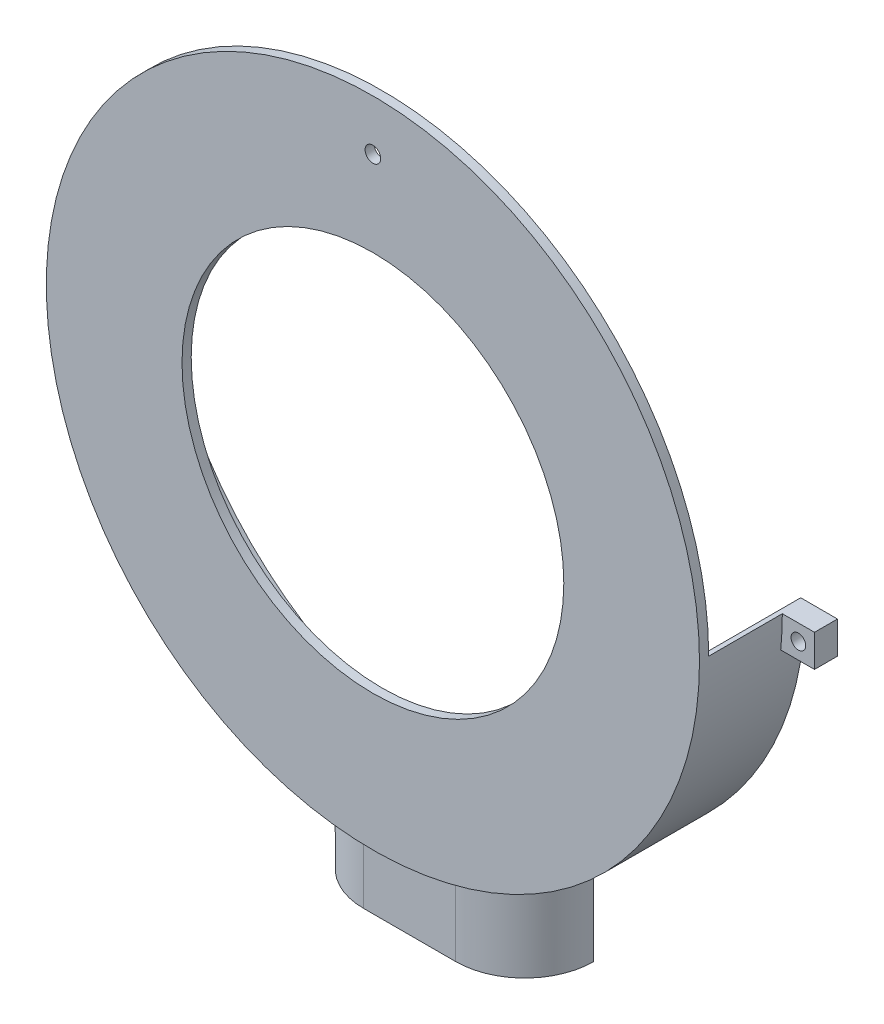
ISO-10303-21;
HEADER;
FILE_DESCRIPTION(('STEP AP214'),'2;1');
FILE_NAME('part.step','',(''),(''),'','','');
FILE_SCHEMA(('AUTOMOTIVE_DESIGN { 1 0 10303 214 1 1 1 1 }'));
ENDSEC;
DATA;
#1=APPLICATION_CONTEXT('core data for automotive mechanical design processes');
#2=APPLICATION_PROTOCOL_DEFINITION('international standard','automotive_design',2000,#1);
#3=PRODUCT_CONTEXT('',#1,'mechanical');
#4=PRODUCT('Part','Part','',(#3));
#5=PRODUCT_RELATED_PRODUCT_CATEGORY('part','',(#4));
#6=PRODUCT_DEFINITION_FORMATION('','',#4);
#7=PRODUCT_DEFINITION_CONTEXT('part definition',#1,'design');
#8=PRODUCT_DEFINITION('design','',#6,#7);
#9=PRODUCT_DEFINITION_SHAPE('','',#8);
#10=(LENGTH_UNIT() NAMED_UNIT(*) SI_UNIT(.MILLI.,.METRE.));
#11=(NAMED_UNIT(*) PLANE_ANGLE_UNIT() SI_UNIT($,.RADIAN.));
#12=(NAMED_UNIT(*) SI_UNIT($,.STERADIAN.) SOLID_ANGLE_UNIT());
#13=UNCERTAINTY_MEASURE_WITH_UNIT(LENGTH_MEASURE(1.E-05),#10,'distance_accuracy_value','');
#14=(GEOMETRIC_REPRESENTATION_CONTEXT(3) GLOBAL_UNCERTAINTY_ASSIGNED_CONTEXT((#13)) GLOBAL_UNIT_ASSIGNED_CONTEXT((#10,
#11,#12)) REPRESENTATION_CONTEXT('',''));
#15=CARTESIAN_POINT('',(0.,0.,0.));
#16=DIRECTION('',(0.,0.,1.));
#17=DIRECTION('',(1.,0.,0.));
#18=AXIS2_PLACEMENT_3D('',#15,#16,#17);
#19=CARTESIAN_POINT('',(0.,0.,0.));
#20=DIRECTION('',(0.,0.,1.));
#21=DIRECTION('',(1.,0.,0.));
#22=AXIS2_PLACEMENT_3D('',#19,#20,#21);
#23=PLANE('',#22);
#24=CARTESIAN_POINT('',(74.5,-3.49999999999999,0.));
#25=DIRECTION('',(0.,0.,-1.));
#26=DIRECTION('',(-1.,0.,0.));
#27=AXIS2_PLACEMENT_3D('',#24,#25,#26);
#28=CIRCLE('',#27,1.60000000000001);
#29=CARTESIAN_POINT('',(72.9,-3.49999999999999,0.));
#30=VERTEX_POINT('',#29);
#31=EDGE_CURVE('E355',#30,#30,#28,.T.);
#32=ORIENTED_EDGE('',*,*,#31,.F.);
#33=EDGE_LOOP('',(#32));
#34=FACE_BOUND('',#33,.T.);
#35=CARTESIAN_POINT('',(-74.5,-3.50000000000002,0.));
#36=DIRECTION('',(0.,0.,1.));
#37=DIRECTION('',(1.,0.,0.));
#38=AXIS2_PLACEMENT_3D('',#35,#36,#37);
#39=CIRCLE('',#38,1.60000000000001);
#40=CARTESIAN_POINT('',(-72.9,-3.50000000000002,0.));
#41=VERTEX_POINT('',#40);
#42=EDGE_CURVE('E332',#41,#41,#39,.T.);
#43=ORIENTED_EDGE('',*,*,#42,.T.);
#44=EDGE_LOOP('',(#43));
#45=FACE_BOUND('',#44,.T.);
#46=DIRECTION('',(0.,-1.,0.));
#47=VECTOR('',#46,1.);
#48=CARTESIAN_POINT('',(21.6189500386222,-71.,0.));
#49=LINE('',#48,#47);
#50=CARTESIAN_POINT('',(21.6189500386222,-71.,0.));
#51=VERTEX_POINT('',#50);
#52=CARTESIAN_POINT('',(21.6189500386222,-91.,0.));
#53=VERTEX_POINT('',#52);
#54=EDGE_CURVE('E330',#51,#53,#49,.T.);
#55=ORIENTED_EDGE('',*,*,#54,.F.);
#56=DIRECTION('',(1.,0.,0.));
#57=VECTOR('',#56,1.);
#58=CARTESIAN_POINT('',(0.,-71.,0.));
#59=LINE('',#58,#57);
#60=CARTESIAN_POINT('',(-21.6189500386223,-71.,0.));
#61=VERTEX_POINT('',#60);
#62=EDGE_CURVE('E294',#61,#51,#59,.T.);
#63=ORIENTED_EDGE('',*,*,#62,.F.);
#64=DIRECTION('',(0.,-1.,0.));
#65=VECTOR('',#64,1.);
#66=CARTESIAN_POINT('',(-21.6189500386223,-71.,0.));
#67=LINE('',#66,#65);
#68=CARTESIAN_POINT('',(-21.6189500386223,-91.,0.));
#69=VERTEX_POINT('',#68);
#70=EDGE_CURVE('E333',#61,#69,#67,.T.);
#71=ORIENTED_EDGE('',*,*,#70,.T.);
#72=DIRECTION('',(-1.,0.,0.));
#73=VECTOR('',#72,1.);
#74=CARTESIAN_POINT('',(0.,-91.,0.));
#75=LINE('',#74,#73);
#76=CARTESIAN_POINT('',(-25.,-91.,0.));
#77=VERTEX_POINT('',#76);
#78=EDGE_CURVE('E408',#69,#77,#75,.T.);
#79=ORIENTED_EDGE('',*,*,#78,.T.);
#80=DIRECTION('',(0.,1.,0.));
#81=VECTOR('',#80,1.);
#82=CARTESIAN_POINT('',(-25.,0.,0.));
#83=LINE('',#82,#81);
#84=CARTESIAN_POINT('',(-25.,-66.4529909033446,0.));
#85=VERTEX_POINT('',#84);
#86=EDGE_CURVE('E402',#77,#85,#83,.T.);
#87=ORIENTED_EDGE('',*,*,#86,.T.);
#88=CARTESIAN_POINT('',(0.,0.,0.));
#89=DIRECTION('',(0.,0.,1.));
#90=DIRECTION('',(1.,0.,0.));
#91=AXIS2_PLACEMENT_3D('',#88,#89,#90);
#92=CIRCLE('',#91,71.);
#93=CARTESIAN_POINT('',(-70.6540869306228,-7.00000000000003,0.));
#94=VERTEX_POINT('',#93);
#95=EDGE_CURVE('E439',#94,#85,#92,.T.);
#96=ORIENTED_EDGE('',*,*,#95,.F.);
#97=DIRECTION('',(1.,0.,0.));
#98=VECTOR('',#97,1.);
#99=CARTESIAN_POINT('',(-73.,-7.00000000000003,0.));
#100=LINE('',#99,#98);
#101=CARTESIAN_POINT('',(-78.,-7.00000000000003,0.));
#102=VERTEX_POINT('',#101);
#103=EDGE_CURVE('E383',#102,#94,#100,.T.);
#104=ORIENTED_EDGE('',*,*,#103,.F.);
#105=DIRECTION('',(0.,-1.,0.));
#106=VECTOR('',#105,1.);
#107=CARTESIAN_POINT('',(-78.,0.,0.));
#108=LINE('',#107,#106);
#109=CARTESIAN_POINT('',(-78.,0.,0.));
#110=VERTEX_POINT('',#109);
#111=EDGE_CURVE('E376',#110,#102,#108,.T.);
#112=ORIENTED_EDGE('',*,*,#111,.F.);
#113=DIRECTION('',(1.,0.,0.));
#114=VECTOR('',#113,1.);
#115=CARTESIAN_POINT('',(0.,0.,0.));
#116=LINE('',#115,#114);
#117=CARTESIAN_POINT('',(-70.,0.,0.));
#118=VERTEX_POINT('',#117);
#119=EDGE_CURVE('E435',#110,#118,#116,.T.);
#120=ORIENTED_EDGE('',*,*,#119,.T.);
#121=CARTESIAN_POINT('',(0.,0.,0.));
#122=DIRECTION('',(0.,0.,1.));
#123=DIRECTION('',(1.,0.,0.));
#124=AXIS2_PLACEMENT_3D('',#121,#122,#123);
#125=CIRCLE('',#124,70.);
#126=CARTESIAN_POINT('',(70.,0.,0.));
#127=VERTEX_POINT('',#126);
#128=EDGE_CURVE('E421',#118,#127,#125,.T.);
#129=ORIENTED_EDGE('',*,*,#128,.T.);
#130=CARTESIAN_POINT('',(78.,0.,0.));
#131=VERTEX_POINT('',#130);
#132=EDGE_CURVE('E430',#127,#131,#116,.T.);
#133=ORIENTED_EDGE('',*,*,#132,.T.);
#134=DIRECTION('',(0.,-1.,0.));
#135=VECTOR('',#134,1.);
#136=CARTESIAN_POINT('',(78.,0.,0.));
#137=LINE('',#136,#135);
#138=CARTESIAN_POINT('',(78.,-7.,0.));
#139=VERTEX_POINT('',#138);
#140=EDGE_CURVE('E345',#131,#139,#137,.T.);
#141=ORIENTED_EDGE('',*,*,#140,.T.);
#142=DIRECTION('',(-1.,0.,0.));
#143=VECTOR('',#142,1.);
#144=CARTESIAN_POINT('',(0.,-7.,0.));
#145=LINE('',#144,#143);
#146=CARTESIAN_POINT('',(70.6540869306228,-7.,0.));
#147=VERTEX_POINT('',#146);
#148=EDGE_CURVE('E358',#139,#147,#145,.T.);
#149=ORIENTED_EDGE('',*,*,#148,.T.);
#150=CARTESIAN_POINT('',(25.,-66.4529909033446,0.));
#151=VERTEX_POINT('',#150);
#152=EDGE_CURVE('E438',#151,#147,#92,.T.);
#153=ORIENTED_EDGE('',*,*,#152,.F.);
#154=DIRECTION('',(0.,1.,0.));
#155=VECTOR('',#154,1.);
#156=CARTESIAN_POINT('',(25.,0.,0.));
#157=LINE('',#156,#155);
#158=CARTESIAN_POINT('',(25.,-91.,0.));
#159=VERTEX_POINT('',#158);
#160=EDGE_CURVE('E405',#159,#151,#157,.T.);
#161=ORIENTED_EDGE('',*,*,#160,.F.);
#162=EDGE_CURVE('E409',#159,#53,#75,.T.);
#163=ORIENTED_EDGE('',*,*,#162,.T.);
#164=EDGE_LOOP('',(#55,#63,#71,#79,#87,#96,#104,#112,#120,#129,#133,#141,#149,#153,#161,#163));
#165=FACE_BOUND('',#164,.T.);
#166=ADVANCED_FACE('F143',(#34,#45,#165),#23,.F.);
#167=CARTESIAN_POINT('',(0.,-91.,15.));
#168=DIRECTION('',(0.,-1.,0.));
#169=DIRECTION('',(0.,0.,-1.));
#170=AXIS2_PLACEMENT_3D('',#167,#168,#169);
#171=PLANE('',#170);
#172=CARTESIAN_POINT('',(10.,-91.,0.));
#173=DIRECTION('',(0.,-1.,0.));
#174=DIRECTION('',(0.,0.,-1.));
#175=AXIS2_PLACEMENT_3D('',#172,#173,#174);
#176=CIRCLE('',#175,12.);
#177=CARTESIAN_POINT('',(21.6189500386222,-91.,3.));
#178=VERTEX_POINT('',#177);
#179=CARTESIAN_POINT('',(10.,-91.,12.));
#180=VERTEX_POINT('',#179);
#181=EDGE_CURVE('E320',#178,#180,#176,.T.);
#182=ORIENTED_EDGE('',*,*,#181,.F.);
#183=DIRECTION('',(0.,0.,-1.));
#184=VECTOR('',#183,1.);
#185=CARTESIAN_POINT('',(21.6189500386222,-91.,0.));
#186=LINE('',#185,#184);
#187=EDGE_CURVE('E164',#178,#53,#186,.T.);
#188=ORIENTED_EDGE('',*,*,#187,.T.);
#189=ORIENTED_EDGE('',*,*,#162,.F.);
#190=CARTESIAN_POINT('',(10.,-91.,0.));
#191=DIRECTION('',(0.,-1.,0.));
#192=DIRECTION('',(0.,0.,-1.));
#193=AXIS2_PLACEMENT_3D('',#190,#191,#192);
#194=CIRCLE('',#193,15.);
#195=CARTESIAN_POINT('',(10.,-91.,15.));
#196=VERTEX_POINT('',#195);
#197=EDGE_CURVE('E456',#159,#196,#194,.T.);
#198=ORIENTED_EDGE('',*,*,#197,.T.);
#199=DIRECTION('',(-1.,0.,0.));
#200=VECTOR('',#199,1.);
#201=CARTESIAN_POINT('',(0.,-91.,15.));
#202=LINE('',#201,#200);
#203=CARTESIAN_POINT('',(-10.,-91.,15.));
#204=VERTEX_POINT('',#203);
#205=EDGE_CURVE('E399',#196,#204,#202,.T.);
#206=ORIENTED_EDGE('',*,*,#205,.T.);
#207=CARTESIAN_POINT('',(-10.,-91.,0.));
#208=DIRECTION('',(0.,-1.,0.));
#209=DIRECTION('',(0.,0.,-1.));
#210=AXIS2_PLACEMENT_3D('',#207,#208,#209);
#211=CIRCLE('',#210,15.);
#212=EDGE_CURVE('E458',#204,#77,#211,.T.);
#213=ORIENTED_EDGE('',*,*,#212,.T.);
#214=ORIENTED_EDGE('',*,*,#78,.F.);
#215=DIRECTION('',(0.,0.,-1.));
#216=VECTOR('',#215,1.);
#217=CARTESIAN_POINT('',(-21.6189500386223,-91.,0.));
#218=LINE('',#217,#216);
#219=CARTESIAN_POINT('',(-21.6189500386223,-91.,3.));
#220=VERTEX_POINT('',#219);
#221=EDGE_CURVE('E304',#220,#69,#218,.T.);
#222=ORIENTED_EDGE('',*,*,#221,.F.);
#223=CARTESIAN_POINT('',(-10.,-91.,0.));
#224=DIRECTION('',(0.,-1.,0.));
#225=DIRECTION('',(0.,0.,-1.));
#226=AXIS2_PLACEMENT_3D('',#223,#224,#225);
#227=CIRCLE('',#226,12.);
#228=CARTESIAN_POINT('',(-10.,-91.,12.));
#229=VERTEX_POINT('',#228);
#230=EDGE_CURVE('E326',#229,#220,#227,.T.);
#231=ORIENTED_EDGE('',*,*,#230,.F.);
#232=DIRECTION('',(-1.,0.,0.));
#233=VECTOR('',#232,1.);
#234=CARTESIAN_POINT('',(0.,-91.,12.));
#235=LINE('',#234,#233);
#236=EDGE_CURVE('E323',#180,#229,#235,.T.);
#237=ORIENTED_EDGE('',*,*,#236,.F.);
#238=EDGE_LOOP('',(#182,#188,#189,#198,#206,#213,#214,#222,#231,#237));
#239=FACE_BOUND('',#238,.T.);
#240=ADVANCED_FACE('F484',(#239),#171,.T.);
#241=CARTESIAN_POINT('',(0.,0.,21.));
#242=DIRECTION('',(0.,0.,-1.));
#243=DIRECTION('',(-1.,0.,0.));
#244=AXIS2_PLACEMENT_3D('',#241,#242,#243);
#245=CYLINDRICAL_SURFACE('',#244,71.);
#246=ORIENTED_EDGE('',*,*,#95,.T.);
#247=CARTESIAN_POINT('',(-25.,-66.4529909033446,0.));
#248=CARTESIAN_POINT('',(-25.0000005903524,-66.4529892917345,0.202890123291094));
#249=CARTESIAN_POINT('',(-24.9958827959298,-66.4545399945073,0.405754132783713));
#250=CARTESIAN_POINT('',(-24.9794283711578,-66.4607272766142,0.811094434555971));
#251=CARTESIAN_POINT('',(-24.9670920257694,-66.4653637489557,1.01357074003433));
#252=CARTESIAN_POINT('',(-24.917797028508,-66.4838680768963,1.61974669485583));
#253=CARTESIAN_POINT('',(-24.8685523791685,-66.5023308782734,2.02238403361912));
#254=CARTESIAN_POINT('',(-24.737993198442,-66.5510066828299,2.82038996686675));
#255=CARTESIAN_POINT('',(-24.6567755820139,-66.5811841731827,3.21577678312238));
#256=CARTESIAN_POINT('',(-24.4630499639891,-66.6526056042619,3.99780486330627));
#257=CARTESIAN_POINT('',(-24.3505410103259,-66.6938498817037,4.38444586074817));
#258=CARTESIAN_POINT('',(-24.0953419993637,-66.7864723363784,5.14612284370514));
#259=CARTESIAN_POINT('',(-23.9526689943176,-66.8378447868793,5.52116524936546));
#260=CARTESIAN_POINT('',(-23.638324992462,-66.9496631926846,6.25750406523527));
#261=CARTESIAN_POINT('',(-23.4666523229956,-67.0101096713426,6.61879968107707));
#262=CARTESIAN_POINT('',(-23.0956020324913,-67.1388987831489,7.325612948941));
#263=CARTESIAN_POINT('',(-22.8962112994059,-67.2072451507505,7.67112303022247));
#264=CARTESIAN_POINT('',(-22.4712659315399,-67.3505194327208,8.34421645846842));
#265=CARTESIAN_POINT('',(-22.2457107012023,-67.4254474968928,8.67179939712486));
#266=CARTESIAN_POINT('',(-21.7615525631412,-67.5832961350776,9.31851766812734));
#267=CARTESIAN_POINT('',(-21.5020617801036,-67.6664058484265,9.63694224659087));
#268=CARTESIAN_POINT('',(-20.9583899157298,-67.8367677003514,10.2509462698629));
#269=CARTESIAN_POINT('',(-20.6742009101862,-67.9240211643104,10.5465183247368));
#270=CARTESIAN_POINT('',(-20.0829901748955,-68.1011653816012,11.1130988985723));
#271=CARTESIAN_POINT('',(-19.7759650826353,-68.1910565221346,11.3841037870398));
#272=CARTESIAN_POINT('',(-19.1410012430146,-68.3720048524889,11.8999762900218));
#273=CARTESIAN_POINT('',(-18.8130617028942,-68.4630620864058,12.1448429128263));
#274=CARTESIAN_POINT('',(-18.1218416025611,-68.6493487369842,12.6182231879232));
#275=CARTESIAN_POINT('',(-17.7576183066252,-68.744566193301,12.845366685592));
#276=CARTESIAN_POINT('',(-17.0108165521357,-68.9331587207391,13.2677206815555));
#277=CARTESIAN_POINT('',(-16.6282441960605,-69.0265343900152,13.4629417025938));
#278=CARTESIAN_POINT('',(-15.8472721857437,-69.2100050478546,13.8200473386814));
#279=CARTESIAN_POINT('',(-15.4488785608921,-69.3001012615813,13.9819445105397));
#280=CARTESIAN_POINT('',(-14.6388107248533,-69.4757285989762,14.2711708026575));
#281=CARTESIAN_POINT('',(-14.2271392023012,-69.5612606376462,14.3985068726197));
#282=CARTESIAN_POINT('',(-13.5009067949091,-69.7052730446685,14.5892427530184));
#283=CARTESIAN_POINT('',(-13.1886811773013,-69.7650412692188,14.660662313501));
#284=CARTESIAN_POINT('',(-12.559703961304,-69.881013679575,14.7834554064761));
#285=CARTESIAN_POINT('',(-12.242953253642,-69.9372185552684,14.8348328292425));
#286=CARTESIAN_POINT('',(-11.6062572804768,-70.045691676637,14.9172020304908));
#287=CARTESIAN_POINT('',(-11.2863131375469,-70.0979612540486,14.9482007330017));
#288=CARTESIAN_POINT('',(-10.6443571537927,-70.1983170317084,14.9896100135823));
#289=CARTESIAN_POINT('',(-10.3223447877684,-70.2464021202939,15.0000151365729));
#290=CARTESIAN_POINT('',(-10.,-70.2922470831599,15.));
#291=B_SPLINE_CURVE_WITH_KNOTS('',3,(#247,#248,#249,#250,#251,#252,#253,#254,#255,#256,#257,
#258,#259,#260,#261,#262,#263,#264,#265,#266,#267,#268,#269,#270,#271,#272,#273,#274,#275,#276,
#277,#278,#279,#280,#281,#282,#283,#284,#285,#286,#287,#288,#289,#290),.UNSPECIFIED.,.F.,.F.,(4,
2,2,2,2,2,2,2,2,2,2,2,2,2,2,2,2,2,2,2,2,4),(0.,0.608570725485435,1.21712035115968,
2.43364958759041,3.6465193843696,4.85942608782073,6.07164893913068,7.28394173351149,
8.4968099677002,9.70970581465124,10.9655839571441,12.2218665352263,13.4783344629911,
14.7348500453823,16.052339464034,17.3693937136526,18.6859507698999,20.0022428904329,
20.9790765747016,21.9557205564564,22.9320325344798,23.9086030953595),.UNSPECIFIED.);
#292=CARTESIAN_POINT('',(-10.,-70.2922470831599,15.));
#293=VERTEX_POINT('',#292);
#294=EDGE_CURVE('E157',#85,#293,#291,.T.);
#295=ORIENTED_EDGE('',*,*,#294,.T.);
#296=CARTESIAN_POINT('',(0.,0.,15.));
#297=DIRECTION('',(0.,0.,-1.));
#298=DIRECTION('',(-1.,0.,0.));
#299=AXIS2_PLACEMENT_3D('',#296,#297,#298);
#300=CIRCLE('',#299,71.);
#301=CARTESIAN_POINT('',(10.,-70.2922470831599,15.));
#302=VERTEX_POINT('',#301);
#303=EDGE_CURVE('E401',#302,#293,#300,.T.);
#304=ORIENTED_EDGE('',*,*,#303,.F.);
#305=CARTESIAN_POINT('',(10.,-70.2922470831599,15.));
#306=CARTESIAN_POINT('',(10.2139363859511,-70.2618131813049,14.9999999695141));
#307=CARTESIAN_POINT('',(10.4277051094957,-70.2304036050421,14.9954224227743));
#308=CARTESIAN_POINT('',(10.8545616919083,-70.1656971947847,14.9771615807701));
#309=CARTESIAN_POINT('',(11.0676495677583,-70.1324004082562,14.9634785144299));
#310=CARTESIAN_POINT('',(11.7051948561132,-70.0298043608516,14.9088613094986));
#311=CARTESIAN_POINT('',(12.1281307104455,-69.9577713905516,14.8543590709993));
#312=CARTESIAN_POINT('',(12.9658575720154,-69.8073592833812,14.7099992636987));
#313=CARTESIAN_POINT('',(13.38066245696,-69.7289923927318,14.6202086824519));
#314=CARTESIAN_POINT('',(14.2002005596321,-69.5667218100454,14.4061675282177));
#315=CARTESIAN_POINT('',(14.6049333766161,-69.482817898187,14.2819155864766));
#316=CARTESIAN_POINT('',(15.4014290237364,-69.3106193224046,14.0001054081002));
#317=CARTESIAN_POINT('',(15.7931979514005,-69.2223267730018,13.8425630946279));
#318=CARTESIAN_POINT('',(16.5614840552444,-69.0425442255805,13.4953562211368));
#319=CARTESIAN_POINT('',(16.938000614122,-68.9510540984265,13.3056903626025));
#320=CARTESIAN_POINT('',(17.6735305808308,-68.7661993899087,12.8955148799361));
#321=CARTESIAN_POINT('',(18.032537974225,-68.6728341797823,12.6749947565357));
#322=CARTESIAN_POINT('',(18.7306774207431,-68.4857090970559,12.2046075236882));
#323=CARTESIAN_POINT('',(19.0698091836421,-68.3919492187143,11.9547399858686));
#324=CARTESIAN_POINT('',(19.7333109621519,-68.2035043083046,11.4213751539266));
#325=CARTESIAN_POINT('',(20.0571892910213,-68.1088446037796,11.1372568191024));
#326=CARTESIAN_POINT('',(20.6797377755465,-67.9224119999273,10.541761974096));
#327=CARTESIAN_POINT('',(20.978408146774,-67.8306390759171,10.2303856970631));
#328=CARTESIAN_POINT('',(21.5484605400567,-67.6517045696799,9.58224126580219));
#329=CARTESIAN_POINT('',(21.8198378835186,-67.5645437792779,9.24546877538898));
#330=CARTESIAN_POINT('',(22.3331625384014,-67.3966082376737,8.5487036026553));
#331=CARTESIAN_POINT('',(22.5751109373863,-67.3158332505191,8.18871177917181));
#332=CARTESIAN_POINT('',(23.0255159856525,-67.1630975470954,7.45123442050554));
#333=CARTESIAN_POINT('',(23.2342590464413,-67.0910628877752,7.07393927329259));
#334=CARTESIAN_POINT('',(23.6190459412865,-66.9565697350019,6.30141160948439));
#335=CARTESIAN_POINT('',(23.795092157202,-66.8941105440649,5.90618040208504));
#336=CARTESIAN_POINT('',(24.1126449130714,-66.7803025975163,5.10100870037129));
#337=CARTESIAN_POINT('',(24.2541888866319,-66.7289418074986,4.69108470625582));
#338=CARTESIAN_POINT('',(24.5014780114503,-66.638539031647,3.85944868122548));
#339=CARTESIAN_POINT('',(24.60723609383,-66.5994925964062,3.43774096808075));
#340=CARTESIAN_POINT('',(24.7958654854792,-66.5295194123323,2.51729050082726));
#341=CARTESIAN_POINT('',(24.8723544259504,-66.5008961545058,2.01703122498264));
#342=CARTESIAN_POINT('',(24.9488991574379,-66.4721976200543,1.26268578907946));
#343=CARTESIAN_POINT('',(24.9680492680456,-66.4650041891141,1.01064489386477));
#344=CARTESIAN_POINT('',(24.9936017649907,-66.4553984058687,0.505754579709946));
#345=CARTESIAN_POINT('',(25.000000495831,-66.4529874245715,0.252904949727254));
#346=CARTESIAN_POINT('',(25.,-66.4529909033446,0.));
#347=B_SPLINE_CURVE_WITH_KNOTS('',3,(#305,#306,#307,#308,#309,#310,#311,#312,#313,#314,#315,
#316,#317,#318,#319,#320,#321,#322,#323,#324,#325,#326,#327,#328,#329,#330,#331,#332,#333,#334,
#335,#336,#337,#338,#339,#340,#341,#342,#343,#344,#345,#346),.UNSPECIFIED.,.F.,.F.,(4,2,2,2,2,2,
2,2,2,2,2,2,2,2,2,2,2,2,2,2,4),(0.,0.648163931239846,1.2963115674376,2.59201254012226,
3.88526568393931,5.17857020120226,6.47125751081972,7.76399708662323,9.05717763808697,
10.350377067933,11.6721482407039,12.9939081088883,14.31589416942,15.6378313603238,
16.9476628861356,18.2573989575104,19.5657076266864,20.8735430364311,22.3909334861488,
23.1492287751872,23.9077414170007),.UNSPECIFIED.);
#348=EDGE_CURVE('E12',#302,#151,#347,.T.);
#349=ORIENTED_EDGE('',*,*,#348,.T.);
#350=ORIENTED_EDGE('',*,*,#152,.T.);
#351=DIRECTION('',(0.,0.,-1.));
#352=VECTOR('',#351,1.);
#353=CARTESIAN_POINT('',(70.6540869306228,-7.,5.));
#354=LINE('',#353,#352);
#355=CARTESIAN_POINT('',(70.6540869306228,-7.,5.));
#356=VERTEX_POINT('',#355);
#357=EDGE_CURVE('E354',#356,#147,#354,.T.);
#358=ORIENTED_EDGE('',*,*,#357,.F.);
#359=CARTESIAN_POINT('',(0.,0.,5.));
#360=DIRECTION('',(0.,0.,-1.));
#361=DIRECTION('',(-1.,0.,0.));
#362=AXIS2_PLACEMENT_3D('',#359,#360,#361);
#363=CIRCLE('',#362,71.);
#364=CARTESIAN_POINT('',(71.,0.,5.));
#365=VERTEX_POINT('',#364);
#366=EDGE_CURVE('E398',#365,#356,#363,.T.);
#367=ORIENTED_EDGE('',*,*,#366,.F.);
#368=DIRECTION('',(0.,0.,-1.));
#369=VECTOR('',#368,1.);
#370=CARTESIAN_POINT('',(71.,0.,21.));
#371=LINE('',#370,#369);
#372=CARTESIAN_POINT('',(71.,0.,21.));
#373=VERTEX_POINT('',#372);
#374=EDGE_CURVE('E445',#373,#365,#371,.T.);
#375=ORIENTED_EDGE('',*,*,#374,.F.);
#376=CARTESIAN_POINT('',(0.,0.,21.));
#377=DIRECTION('',(0.,0.,1.));
#378=DIRECTION('',(1.,0.,0.));
#379=AXIS2_PLACEMENT_3D('',#376,#377,#378);
#380=CIRCLE('',#379,71.);
#381=CARTESIAN_POINT('',(-71.,0.,21.));
#382=VERTEX_POINT('',#381);
#383=EDGE_CURVE('E418',#373,#382,#380,.T.);
#384=ORIENTED_EDGE('',*,*,#383,.T.);
#385=DIRECTION('',(0.,0.,-1.));
#386=VECTOR('',#385,1.);
#387=CARTESIAN_POINT('',(-71.,0.,21.));
#388=LINE('',#387,#386);
#389=CARTESIAN_POINT('',(-71.,0.,5.));
#390=VERTEX_POINT('',#389);
#391=EDGE_CURVE('E448',#382,#390,#388,.T.);
#392=ORIENTED_EDGE('',*,*,#391,.T.);
#393=CARTESIAN_POINT('',(-70.6540869306228,-7.00000000000003,5.));
#394=VERTEX_POINT('',#393);
#395=EDGE_CURVE('E366',#394,#390,#363,.T.);
#396=ORIENTED_EDGE('',*,*,#395,.F.);
#397=DIRECTION('',(0.,0.,-1.));
#398=VECTOR('',#397,1.);
#399=CARTESIAN_POINT('',(-70.6540869306228,-7.00000000000003,5.));
#400=LINE('',#399,#398);
#401=EDGE_CURVE('E370',#394,#94,#400,.T.);
#402=ORIENTED_EDGE('',*,*,#401,.T.);
#403=EDGE_LOOP('',(#246,#295,#304,#349,#350,#358,#367,#375,#384,#392,#396,#402));
#404=FACE_BOUND('',#403,.T.);
#405=CARTESIAN_POINT('',(0.,0.,23.));
#406=DIRECTION('',(0.,0.,1.));
#407=DIRECTION('',(1.,0.,0.));
#408=AXIS2_PLACEMENT_3D('',#405,#406,#407);
#409=CIRCLE('',#408,71.);
#410=CARTESIAN_POINT('',(71.,0.,23.));
#411=VERTEX_POINT('',#410);
#412=EDGE_CURVE('E417',#411,#411,#409,.T.);
#413=ORIENTED_EDGE('',*,*,#412,.F.);
#414=EDGE_LOOP('',(#413));
#415=FACE_BOUND('',#414,.T.);
#416=ADVANCED_FACE('F464',(#404,#415),#245,.T.);
#417=CARTESIAN_POINT('',(0.,0.,21.));
#418=DIRECTION('',(0.,0.,-1.));
#419=DIRECTION('',(-1.,0.,0.));
#420=AXIS2_PLACEMENT_3D('',#417,#418,#419);
#421=CYLINDRICAL_SURFACE('',#420,70.);
#422=DIRECTION('',(0.,0.,-1.));
#423=VECTOR('',#422,1.);
#424=CARTESIAN_POINT('',(70.,0.,21.));
#425=LINE('',#424,#423);
#426=CARTESIAN_POINT('',(70.,0.,21.));
#427=VERTEX_POINT('',#426);
#428=EDGE_CURVE('E442',#427,#127,#425,.T.);
#429=ORIENTED_EDGE('',*,*,#428,.T.);
#430=ORIENTED_EDGE('',*,*,#128,.F.);
#431=DIRECTION('',(0.,0.,-1.));
#432=VECTOR('',#431,1.);
#433=CARTESIAN_POINT('',(-70.,0.,21.));
#434=LINE('',#433,#432);
#435=CARTESIAN_POINT('',(-70.,0.,21.));
#436=VERTEX_POINT('',#435);
#437=EDGE_CURVE('E450',#436,#118,#434,.T.);
#438=ORIENTED_EDGE('',*,*,#437,.F.);
#439=CARTESIAN_POINT('',(0.,0.,21.));
#440=DIRECTION('',(0.,0.,1.));
#441=DIRECTION('',(1.,0.,0.));
#442=AXIS2_PLACEMENT_3D('',#439,#440,#441);
#443=CIRCLE('',#442,70.);
#444=EDGE_CURVE('E426',#436,#427,#443,.T.);
#445=ORIENTED_EDGE('',*,*,#444,.T.);
#446=EDGE_LOOP('',(#429,#430,#438,#445));
#447=FACE_BOUND('',#446,.T.);
#448=ADVANCED_FACE('F474',(#447),#421,.F.);
#449=CARTESIAN_POINT('',(0.,0.,21.));
#450=DIRECTION('',(0.,1.,0.));
#451=DIRECTION('',(-1.,0.,0.));
#452=AXIS2_PLACEMENT_3D('',#449,#450,#451);
#453=PLANE('',#452);
#454=ORIENTED_EDGE('',*,*,#119,.F.);
#455=DIRECTION('',(0.,0.,-1.));
#456=VECTOR('',#455,1.);
#457=CARTESIAN_POINT('',(-78.,0.,5.));
#458=LINE('',#457,#456);
#459=CARTESIAN_POINT('',(-78.,0.,5.));
#460=VERTEX_POINT('',#459);
#461=EDGE_CURVE('E387',#460,#110,#458,.T.);
#462=ORIENTED_EDGE('',*,*,#461,.F.);
#463=DIRECTION('',(-1.,0.,0.));
#464=VECTOR('',#463,1.);
#465=CARTESIAN_POINT('',(-71.,-5.23545925731354E-13,5.));
#466=LINE('',#465,#464);
#467=EDGE_CURVE('E385',#390,#460,#466,.T.);
#468=ORIENTED_EDGE('',*,*,#467,.F.);
#469=ORIENTED_EDGE('',*,*,#391,.F.);
#470=DIRECTION('',(1.,0.,0.));
#471=VECTOR('',#470,1.);
#472=CARTESIAN_POINT('',(0.,0.,21.));
#473=LINE('',#472,#471);
#474=EDGE_CURVE('E429',#382,#436,#473,.T.);
#475=ORIENTED_EDGE('',*,*,#474,.T.);
#476=ORIENTED_EDGE('',*,*,#437,.T.);
#477=EDGE_LOOP('',(#454,#462,#468,#469,#475,#476));
#478=FACE_BOUND('',#477,.T.);
#479=ADVANCED_FACE('F476',(#478),#453,.T.);
#480=ORIENTED_EDGE('',*,*,#132,.F.);
#481=ORIENTED_EDGE('',*,*,#428,.F.);
#482=EDGE_CURVE('E433',#427,#373,#473,.T.);
#483=ORIENTED_EDGE('',*,*,#482,.T.);
#484=ORIENTED_EDGE('',*,*,#374,.T.);
#485=DIRECTION('',(1.,0.,0.));
#486=VECTOR('',#485,1.);
#487=CARTESIAN_POINT('',(0.,-5.51582605187271E-12,5.));
#488=LINE('',#487,#486);
#489=CARTESIAN_POINT('',(78.,0.,5.));
#490=VERTEX_POINT('',#489);
#491=EDGE_CURVE('E348',#365,#490,#488,.T.);
#492=ORIENTED_EDGE('',*,*,#491,.T.);
#493=DIRECTION('',(0.,0.,-1.));
#494=VECTOR('',#493,1.);
#495=CARTESIAN_POINT('',(78.,0.,5.));
#496=LINE('',#495,#494);
#497=EDGE_CURVE('E367',#490,#131,#496,.T.);
#498=ORIENTED_EDGE('',*,*,#497,.T.);
#499=EDGE_LOOP('',(#480,#481,#483,#484,#492,#498));
#500=FACE_BOUND('',#499,.T.);
#501=ADVANCED_FACE('F482',(#500),#453,.T.);
#502=CARTESIAN_POINT('',(0.,0.,23.));
#503=DIRECTION('',(0.,0.,-1.));
#504=DIRECTION('',(-1.,0.,0.));
#505=AXIS2_PLACEMENT_3D('',#502,#503,#504);
#506=CYLINDRICAL_SURFACE('',#505,41.5);
#507=CARTESIAN_POINT('',(0.,0.,21.));
#508=DIRECTION('',(0.,0.,1.));
#509=DIRECTION('',(1.,0.,0.));
#510=AXIS2_PLACEMENT_3D('',#507,#508,#509);
#511=CIRCLE('',#510,41.5);
#512=CARTESIAN_POINT('',(41.5,0.,21.));
#513=VERTEX_POINT('',#512);
#514=EDGE_CURVE('E404',#513,#513,#511,.T.);
#515=ORIENTED_EDGE('',*,*,#514,.F.);
#516=EDGE_LOOP('',(#515));
#517=FACE_BOUND('',#516,.T.);
#518=CARTESIAN_POINT('',(0.,0.,23.));
#519=DIRECTION('',(0.,0.,1.));
#520=DIRECTION('',(1.,0.,0.));
#521=AXIS2_PLACEMENT_3D('',#518,#519,#520);
#522=CIRCLE('',#521,41.5);
#523=CARTESIAN_POINT('',(41.5,0.,23.));
#524=VERTEX_POINT('',#523);
#525=EDGE_CURVE('E414',#524,#524,#522,.T.);
#526=ORIENTED_EDGE('',*,*,#525,.T.);
#527=EDGE_LOOP('',(#526));
#528=FACE_BOUND('',#527,.T.);
#529=ADVANCED_FACE('F497',(#517,#528),#506,.F.);
#530=CARTESIAN_POINT('',(0.,0.,21.));
#531=DIRECTION('',(0.,0.,1.));
#532=DIRECTION('',(1.,0.,0.));
#533=AXIS2_PLACEMENT_3D('',#530,#531,#532);
#534=PLANE('',#533);
#535=CARTESIAN_POINT('',(0.,60.,21.));
#536=DIRECTION('',(0.,0.,1.));
#537=DIRECTION('',(1.,0.,0.));
#538=AXIS2_PLACEMENT_3D('',#535,#536,#537);
#539=CIRCLE('',#538,1.7);
#540=CARTESIAN_POINT('',(1.7,60.,21.));
#541=VERTEX_POINT('',#540);
#542=EDGE_CURVE('E321',#541,#541,#539,.T.);
#543=ORIENTED_EDGE('',*,*,#542,.T.);
#544=EDGE_LOOP('',(#543));
#545=FACE_BOUND('',#544,.T.);
#546=ORIENTED_EDGE('',*,*,#474,.F.);
#547=ORIENTED_EDGE('',*,*,#383,.F.);
#548=ORIENTED_EDGE('',*,*,#482,.F.);
#549=ORIENTED_EDGE('',*,*,#444,.F.);
#550=EDGE_LOOP('',(#546,#547,#548,#549));
#551=FACE_BOUND('',#550,.T.);
#552=ORIENTED_EDGE('',*,*,#514,.T.);
#553=EDGE_LOOP('',(#552));
#554=FACE_BOUND('',#553,.T.);
#555=ADVANCED_FACE('F501',(#545,#551,#554),#534,.F.);
#556=CARTESIAN_POINT('',(0.,0.,23.));
#557=DIRECTION('',(0.,0.,1.));
#558=DIRECTION('',(1.,0.,0.));
#559=AXIS2_PLACEMENT_3D('',#556,#557,#558);
#560=PLANE('',#559);
#561=CARTESIAN_POINT('',(0.,60.,23.));
#562=DIRECTION('',(0.,0.,1.));
#563=DIRECTION('',(1.,0.,0.));
#564=AXIS2_PLACEMENT_3D('',#561,#562,#563);
#565=CIRCLE('',#564,1.7);
#566=CARTESIAN_POINT('',(1.7,60.,23.));
#567=VERTEX_POINT('',#566);
#568=EDGE_CURVE('E574',#567,#567,#565,.T.);
#569=ORIENTED_EDGE('',*,*,#568,.F.);
#570=EDGE_LOOP('',(#569));
#571=FACE_BOUND('',#570,.T.);
#572=ORIENTED_EDGE('',*,*,#525,.F.);
#573=EDGE_LOOP('',(#572));
#574=FACE_BOUND('',#573,.T.);
#575=ORIENTED_EDGE('',*,*,#412,.T.);
#576=EDGE_LOOP('',(#575));
#577=FACE_BOUND('',#576,.T.);
#578=ADVANCED_FACE('F506',(#571,#574,#577),#560,.T.);
#579=CARTESIAN_POINT('',(0.,0.,15.));
#580=DIRECTION('',(0.,0.,-1.));
#581=DIRECTION('',(-1.,0.,0.));
#582=AXIS2_PLACEMENT_3D('',#579,#580,#581);
#583=PLANE('',#582);
#584=ORIENTED_EDGE('',*,*,#303,.T.);
#585=DIRECTION('',(0.,1.,0.));
#586=VECTOR('',#585,1.);
#587=CARTESIAN_POINT('',(-10.,-91.,15.));
#588=LINE('',#587,#586);
#589=EDGE_CURVE('E172',#293,#204,#588,.F.);
#590=ORIENTED_EDGE('',*,*,#589,.T.);
#591=ORIENTED_EDGE('',*,*,#205,.F.);
#592=DIRECTION('',(0.,1.,0.));
#593=VECTOR('',#592,1.);
#594=CARTESIAN_POINT('',(10.,0.,15.));
#595=LINE('',#594,#593);
#596=EDGE_CURVE('E452',#196,#302,#595,.T.);
#597=ORIENTED_EDGE('',*,*,#596,.T.);
#598=EDGE_LOOP('',(#584,#590,#591,#597));
#599=FACE_BOUND('',#598,.T.);
#600=ADVANCED_FACE('F513',(#599),#583,.F.);
#601=CARTESIAN_POINT('',(74.5,-3.49999999999999,5.));
#602=DIRECTION('',(0.,0.,-1.));
#603=DIRECTION('',(-1.,0.,0.));
#604=AXIS2_PLACEMENT_3D('',#601,#602,#603);
#605=CYLINDRICAL_SURFACE('',#604,1.60000000000001);
#606=CARTESIAN_POINT('',(74.5,-3.49999999999999,5.));
#607=DIRECTION('',(0.,0.,-1.));
#608=DIRECTION('',(-1.,0.,0.));
#609=AXIS2_PLACEMENT_3D('',#606,#607,#608);
#610=CIRCLE('',#609,1.60000000000001);
#611=CARTESIAN_POINT('',(72.9,-3.49999999999999,5.));
#612=VERTEX_POINT('',#611);
#613=EDGE_CURVE('E341',#612,#612,#610,.T.);
#614=ORIENTED_EDGE('',*,*,#613,.F.);
#615=EDGE_LOOP('',(#614));
#616=FACE_BOUND('',#615,.T.);
#617=ORIENTED_EDGE('',*,*,#31,.T.);
#618=EDGE_LOOP('',(#617));
#619=FACE_BOUND('',#618,.T.);
#620=ADVANCED_FACE('F521',(#616,#619),#605,.F.);
#621=CARTESIAN_POINT('',(0.,-7.,5.));
#622=DIRECTION('',(0.,-1.,0.));
#623=DIRECTION('',(0.,0.,-1.));
#624=AXIS2_PLACEMENT_3D('',#621,#622,#623);
#625=PLANE('',#624);
#626=ORIENTED_EDGE('',*,*,#148,.F.);
#627=DIRECTION('',(0.,0.,-1.));
#628=VECTOR('',#627,1.);
#629=CARTESIAN_POINT('',(78.,-7.,5.));
#630=LINE('',#629,#628);
#631=CARTESIAN_POINT('',(78.,-7.,5.));
#632=VERTEX_POINT('',#631);
#633=EDGE_CURVE('E364',#632,#139,#630,.T.);
#634=ORIENTED_EDGE('',*,*,#633,.F.);
#635=DIRECTION('',(-1.,0.,0.));
#636=VECTOR('',#635,1.);
#637=CARTESIAN_POINT('',(0.,-7.,5.));
#638=LINE('',#637,#636);
#639=EDGE_CURVE('E344',#632,#356,#638,.T.);
#640=ORIENTED_EDGE('',*,*,#639,.T.);
#641=ORIENTED_EDGE('',*,*,#357,.T.);
#642=EDGE_LOOP('',(#626,#634,#640,#641));
#643=FACE_BOUND('',#642,.T.);
#644=ADVANCED_FACE('F535',(#643),#625,.T.);
#645=CARTESIAN_POINT('',(78.,0.,5.));
#646=DIRECTION('',(1.,0.,0.));
#647=DIRECTION('',(0.,0.,-1.));
#648=AXIS2_PLACEMENT_3D('',#645,#646,#647);
#649=PLANE('',#648);
#650=ORIENTED_EDGE('',*,*,#140,.F.);
#651=ORIENTED_EDGE('',*,*,#497,.F.);
#652=DIRECTION('',(0.,-1.,0.));
#653=VECTOR('',#652,1.);
#654=CARTESIAN_POINT('',(78.,0.,5.));
#655=LINE('',#654,#653);
#656=EDGE_CURVE('E351',#490,#632,#655,.T.);
#657=ORIENTED_EDGE('',*,*,#656,.T.);
#658=ORIENTED_EDGE('',*,*,#633,.T.);
#659=EDGE_LOOP('',(#650,#651,#657,#658));
#660=FACE_BOUND('',#659,.T.);
#661=ADVANCED_FACE('F539',(#660),#649,.T.);
#662=CARTESIAN_POINT('',(0.,0.,5.));
#663=DIRECTION('',(0.,0.,-1.));
#664=DIRECTION('',(-1.,0.,0.));
#665=AXIS2_PLACEMENT_3D('',#662,#663,#664);
#666=PLANE('',#665);
#667=ORIENTED_EDGE('',*,*,#613,.T.);
#668=EDGE_LOOP('',(#667));
#669=FACE_BOUND('',#668,.T.);
#670=ORIENTED_EDGE('',*,*,#491,.F.);
#671=ORIENTED_EDGE('',*,*,#366,.T.);
#672=ORIENTED_EDGE('',*,*,#639,.F.);
#673=ORIENTED_EDGE('',*,*,#656,.F.);
#674=EDGE_LOOP('',(#670,#671,#672,#673));
#675=FACE_BOUND('',#674,.T.);
#676=ADVANCED_FACE('F543',(#669,#675),#666,.F.);
#677=CARTESIAN_POINT('',(-74.5,-3.50000000000002,5.));
#678=DIRECTION('',(0.,0.,1.));
#679=DIRECTION('',(1.,0.,0.));
#680=AXIS2_PLACEMENT_3D('',#677,#678,#679);
#681=CIRCLE('',#680,1.60000000000001);
#682=CARTESIAN_POINT('',(-72.9,-3.50000000000002,5.));
#683=VERTEX_POINT('',#682);
#684=EDGE_CURVE('E373',#683,#683,#681,.T.);
#685=ORIENTED_EDGE('',*,*,#684,.F.);
#686=EDGE_LOOP('',(#685));
#687=FACE_BOUND('',#686,.T.);
#688=DIRECTION('',(-1.,0.,0.));
#689=VECTOR('',#688,1.);
#690=CARTESIAN_POINT('',(-73.,-7.00000000000003,5.));
#691=LINE('',#690,#689);
#692=CARTESIAN_POINT('',(-78.,-7.00000000000003,5.));
#693=VERTEX_POINT('',#692);
#694=EDGE_CURVE('E382',#394,#693,#691,.T.);
#695=ORIENTED_EDGE('',*,*,#694,.F.);
#696=ORIENTED_EDGE('',*,*,#395,.T.);
#697=ORIENTED_EDGE('',*,*,#467,.T.);
#698=DIRECTION('',(0.,-1.,0.));
#699=VECTOR('',#698,1.);
#700=CARTESIAN_POINT('',(-78.,0.,5.));
#701=LINE('',#700,#699);
#702=EDGE_CURVE('E379',#460,#693,#701,.T.);
#703=ORIENTED_EDGE('',*,*,#702,.T.);
#704=EDGE_LOOP('',(#695,#696,#697,#703));
#705=FACE_BOUND('',#704,.T.);
#706=ADVANCED_FACE('F526',(#687,#705),#666,.F.);
#707=CARTESIAN_POINT('',(-74.5,-3.50000000000002,5.));
#708=DIRECTION('',(0.,0.,-1.));
#709=DIRECTION('',(-1.,0.,0.));
#710=AXIS2_PLACEMENT_3D('',#707,#708,#709);
#711=CYLINDRICAL_SURFACE('',#710,1.60000000000001);
#712=ORIENTED_EDGE('',*,*,#684,.T.);
#713=EDGE_LOOP('',(#712));
#714=FACE_BOUND('',#713,.T.);
#715=ORIENTED_EDGE('',*,*,#42,.F.);
#716=EDGE_LOOP('',(#715));
#717=FACE_BOUND('',#716,.T.);
#718=ADVANCED_FACE('F473',(#714,#717),#711,.F.);
#719=CARTESIAN_POINT('',(-73.,-7.00000000000003,5.));
#720=DIRECTION('',(0.,1.,0.));
#721=DIRECTION('',(-1.,0.,0.));
#722=AXIS2_PLACEMENT_3D('',#719,#720,#721);
#723=PLANE('',#722);
#724=ORIENTED_EDGE('',*,*,#401,.F.);
#725=ORIENTED_EDGE('',*,*,#694,.T.);
#726=DIRECTION('',(0.,0.,-1.));
#727=VECTOR('',#726,1.);
#728=CARTESIAN_POINT('',(-78.,-7.00000000000003,5.));
#729=LINE('',#728,#727);
#730=EDGE_CURVE('E359',#693,#102,#729,.T.);
#731=ORIENTED_EDGE('',*,*,#730,.T.);
#732=ORIENTED_EDGE('',*,*,#103,.T.);
#733=EDGE_LOOP('',(#724,#725,#731,#732));
#734=FACE_BOUND('',#733,.T.);
#735=ADVANCED_FACE('F524',(#734),#723,.F.);
#736=CARTESIAN_POINT('',(-78.,0.,5.));
#737=DIRECTION('',(1.,0.,0.));
#738=DIRECTION('',(0.,0.,-1.));
#739=AXIS2_PLACEMENT_3D('',#736,#737,#738);
#740=PLANE('',#739);
#741=ORIENTED_EDGE('',*,*,#111,.T.);
#742=ORIENTED_EDGE('',*,*,#730,.F.);
#743=ORIENTED_EDGE('',*,*,#702,.F.);
#744=ORIENTED_EDGE('',*,*,#461,.T.);
#745=EDGE_LOOP('',(#741,#742,#743,#744));
#746=FACE_BOUND('',#745,.T.);
#747=ADVANCED_FACE('F471',(#746),#740,.F.);
#748=CARTESIAN_POINT('',(-10.,0.,0.));
#749=DIRECTION('',(0.,-1.,0.));
#750=DIRECTION('',(0.,0.,-1.));
#751=AXIS2_PLACEMENT_3D('',#748,#749,#750);
#752=CYLINDRICAL_SURFACE('',#751,15.);
#753=ORIENTED_EDGE('',*,*,#212,.F.);
#754=ORIENTED_EDGE('',*,*,#589,.F.);
#755=ORIENTED_EDGE('',*,*,#294,.F.);
#756=ORIENTED_EDGE('',*,*,#86,.F.);
#757=EDGE_LOOP('',(#753,#754,#755,#756));
#758=FACE_BOUND('',#757,.T.);
#759=ADVANCED_FACE('F468',(#758),#752,.T.);
#760=CARTESIAN_POINT('',(10.,0.,0.));
#761=DIRECTION('',(0.,1.,0.));
#762=DIRECTION('',(0.,0.,1.));
#763=AXIS2_PLACEMENT_3D('',#760,#761,#762);
#764=CYLINDRICAL_SURFACE('',#763,15.);
#765=ORIENTED_EDGE('',*,*,#197,.F.);
#766=ORIENTED_EDGE('',*,*,#160,.T.);
#767=ORIENTED_EDGE('',*,*,#348,.F.);
#768=ORIENTED_EDGE('',*,*,#596,.F.);
#769=EDGE_LOOP('',(#765,#766,#767,#768));
#770=FACE_BOUND('',#769,.T.);
#771=ADVANCED_FACE('F145',(#770),#764,.T.);
#772=CARTESIAN_POINT('',(21.6189500386222,-71.,0.));
#773=DIRECTION('',(-1.,0.,0.));
#774=DIRECTION('',(0.,0.,1.));
#775=AXIS2_PLACEMENT_3D('',#772,#773,#774);
#776=PLANE('',#775);
#777=ORIENTED_EDGE('',*,*,#187,.F.);
#778=DIRECTION('',(0.,-1.,0.));
#779=VECTOR('',#778,1.);
#780=CARTESIAN_POINT('',(21.6189500386222,-71.,3.));
#781=LINE('',#780,#779);
#782=CARTESIAN_POINT('',(21.6189500386222,-71.,3.));
#783=VERTEX_POINT('',#782);
#784=EDGE_CURVE('E284',#783,#178,#781,.T.);
#785=ORIENTED_EDGE('',*,*,#784,.F.);
#786=DIRECTION('',(0.,0.,-1.));
#787=VECTOR('',#786,1.);
#788=CARTESIAN_POINT('',(21.6189500386222,-71.,0.));
#789=LINE('',#788,#787);
#790=EDGE_CURVE('E287',#783,#51,#789,.T.);
#791=ORIENTED_EDGE('',*,*,#790,.T.);
#792=ORIENTED_EDGE('',*,*,#54,.T.);
#793=EDGE_LOOP('',(#777,#785,#791,#792));
#794=FACE_BOUND('',#793,.T.);
#795=ADVANCED_FACE('F286',(#794),#776,.T.);
#796=CARTESIAN_POINT('',(-21.6189500386223,-71.,0.));
#797=DIRECTION('',(-1.,0.,0.));
#798=DIRECTION('',(0.,0.,1.));
#799=AXIS2_PLACEMENT_3D('',#796,#797,#798);
#800=PLANE('',#799);
#801=ORIENTED_EDGE('',*,*,#221,.T.);
#802=ORIENTED_EDGE('',*,*,#70,.F.);
#803=DIRECTION('',(0.,0.,-1.));
#804=VECTOR('',#803,1.);
#805=CARTESIAN_POINT('',(-21.6189500386223,-71.,0.));
#806=LINE('',#805,#804);
#807=CARTESIAN_POINT('',(-21.6189500386223,-71.,3.));
#808=VERTEX_POINT('',#807);
#809=EDGE_CURVE('E316',#808,#61,#806,.T.);
#810=ORIENTED_EDGE('',*,*,#809,.F.);
#811=DIRECTION('',(0.,-1.,0.));
#812=VECTOR('',#811,1.);
#813=CARTESIAN_POINT('',(-21.6189500386223,-71.,3.));
#814=LINE('',#813,#812);
#815=EDGE_CURVE('E336',#808,#220,#814,.T.);
#816=ORIENTED_EDGE('',*,*,#815,.T.);
#817=EDGE_LOOP('',(#801,#802,#810,#816));
#818=FACE_BOUND('',#817,.T.);
#819=ADVANCED_FACE('F550',(#818),#800,.F.);
#820=CARTESIAN_POINT('',(-10.,-71.,0.));
#821=DIRECTION('',(0.,-1.,0.));
#822=DIRECTION('',(0.,0.,-1.));
#823=AXIS2_PLACEMENT_3D('',#820,#821,#822);
#824=CYLINDRICAL_SURFACE('',#823,12.);
#825=ORIENTED_EDGE('',*,*,#230,.T.);
#826=ORIENTED_EDGE('',*,*,#815,.F.);
#827=CARTESIAN_POINT('',(-10.,-71.,0.));
#828=DIRECTION('',(0.,-1.,0.));
#829=DIRECTION('',(0.,0.,-1.));
#830=AXIS2_PLACEMENT_3D('',#827,#828,#829);
#831=CIRCLE('',#830,12.);
#832=CARTESIAN_POINT('',(-10.,-71.,12.));
#833=VERTEX_POINT('',#832);
#834=EDGE_CURVE('E310',#833,#808,#831,.T.);
#835=ORIENTED_EDGE('',*,*,#834,.F.);
#836=DIRECTION('',(0.,-1.,0.));
#837=VECTOR('',#836,1.);
#838=CARTESIAN_POINT('',(-10.,-71.,12.));
#839=LINE('',#838,#837);
#840=EDGE_CURVE('E338',#833,#229,#839,.T.);
#841=ORIENTED_EDGE('',*,*,#840,.T.);
#842=EDGE_LOOP('',(#825,#826,#835,#841));
#843=FACE_BOUND('',#842,.T.);
#844=ADVANCED_FACE('F556',(#843),#824,.F.);
#845=CARTESIAN_POINT('',(0.,-71.,12.));
#846=DIRECTION('',(0.,0.,1.));
#847=DIRECTION('',(1.,0.,0.));
#848=AXIS2_PLACEMENT_3D('',#845,#846,#847);
#849=PLANE('',#848);
#850=ORIENTED_EDGE('',*,*,#236,.T.);
#851=ORIENTED_EDGE('',*,*,#840,.F.);
#852=DIRECTION('',(-1.,0.,0.));
#853=VECTOR('',#852,1.);
#854=CARTESIAN_POINT('',(0.,-71.,12.));
#855=LINE('',#854,#853);
#856=CARTESIAN_POINT('',(10.,-71.,12.));
#857=VERTEX_POINT('',#856);
#858=EDGE_CURVE('E308',#857,#833,#855,.T.);
#859=ORIENTED_EDGE('',*,*,#858,.F.);
#860=DIRECTION('',(0.,-1.,0.));
#861=VECTOR('',#860,1.);
#862=CARTESIAN_POINT('',(10.,-71.,12.));
#863=LINE('',#862,#861);
#864=EDGE_CURVE('E293',#857,#180,#863,.T.);
#865=ORIENTED_EDGE('',*,*,#864,.T.);
#866=EDGE_LOOP('',(#850,#851,#859,#865));
#867=FACE_BOUND('',#866,.T.);
#868=ADVANCED_FACE('F553',(#867),#849,.F.);
#869=CARTESIAN_POINT('',(10.,-71.,0.));
#870=DIRECTION('',(0.,-1.,0.));
#871=DIRECTION('',(0.,0.,-1.));
#872=AXIS2_PLACEMENT_3D('',#869,#870,#871);
#873=CYLINDRICAL_SURFACE('',#872,12.);
#874=ORIENTED_EDGE('',*,*,#181,.T.);
#875=ORIENTED_EDGE('',*,*,#864,.F.);
#876=CARTESIAN_POINT('',(10.,-71.,0.));
#877=DIRECTION('',(0.,-1.,0.));
#878=DIRECTION('',(0.,0.,-1.));
#879=AXIS2_PLACEMENT_3D('',#876,#877,#878);
#880=CIRCLE('',#879,12.);
#881=EDGE_CURVE('E300',#783,#857,#880,.T.);
#882=ORIENTED_EDGE('',*,*,#881,.F.);
#883=ORIENTED_EDGE('',*,*,#784,.T.);
#884=EDGE_LOOP('',(#874,#875,#882,#883));
#885=FACE_BOUND('',#884,.T.);
#886=ADVANCED_FACE('F306',(#885),#873,.F.);
#887=CARTESIAN_POINT('',(0.,-71.,0.));
#888=DIRECTION('',(0.,-1.,0.));
#889=DIRECTION('',(0.,0.,-1.));
#890=AXIS2_PLACEMENT_3D('',#887,#888,#889);
#891=PLANE('',#890);
#892=ORIENTED_EDGE('',*,*,#790,.F.);
#893=ORIENTED_EDGE('',*,*,#881,.T.);
#894=ORIENTED_EDGE('',*,*,#858,.T.);
#895=ORIENTED_EDGE('',*,*,#834,.T.);
#896=ORIENTED_EDGE('',*,*,#809,.T.);
#897=ORIENTED_EDGE('',*,*,#62,.T.);
#898=EDGE_LOOP('',(#892,#893,#894,#895,#896,#897));
#899=FACE_BOUND('',#898,.T.);
#900=ADVANCED_FACE('F298',(#899),#891,.T.);
#901=CARTESIAN_POINT('',(0.,60.,13.));
#902=DIRECTION('',(0.,0.,1.));
#903=DIRECTION('',(1.,0.,0.));
#904=AXIS2_PLACEMENT_3D('',#901,#902,#903);
#905=CYLINDRICAL_SURFACE('',#904,1.7);
#906=ORIENTED_EDGE('',*,*,#568,.T.);
#907=EDGE_LOOP('',(#906));
#908=FACE_BOUND('',#907,.T.);
#909=ORIENTED_EDGE('',*,*,#542,.F.);
#910=EDGE_LOOP('',(#909));
#911=FACE_BOUND('',#910,.T.);
#912=ADVANCED_FACE('F566',(#908,#911),#905,.F.);
#913=CLOSED_SHELL('',(#166,#240,#416,#448,#479,#501,#529,#555,#578,#600,#620,#644,#661,#676,
#706,#718,#735,#747,#759,#771,#795,#819,#844,#868,#886,#900,#912));
#914=MANIFOLD_SOLID_BREP('B2',#913);
#915=ADVANCED_BREP_SHAPE_REPRESENTATION('',(#18,#914),#14);
#916=SHAPE_DEFINITION_REPRESENTATION(#9,#915);
ENDSEC;
END-ISO-10303-21;
